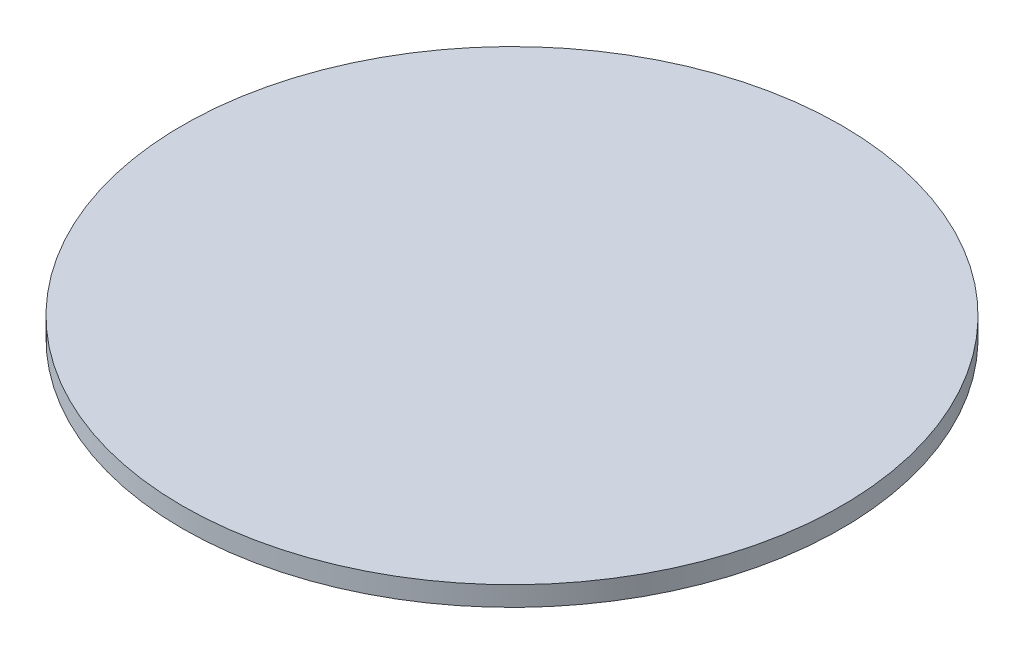
ISO-10303-21;
HEADER;
FILE_DESCRIPTION(('STEP AP214'),'2;1');
FILE_NAME('part.step','',(''),(''),'','','');
FILE_SCHEMA(('AUTOMOTIVE_DESIGN { 1 0 10303 214 1 1 1 1 }'));
ENDSEC;
DATA;
#1=APPLICATION_CONTEXT('core data for automotive mechanical design processes');
#2=APPLICATION_PROTOCOL_DEFINITION('international standard','automotive_design',2000,#1);
#3=PRODUCT_CONTEXT('',#1,'mechanical');
#4=PRODUCT('Part','Part','',(#3));
#5=PRODUCT_RELATED_PRODUCT_CATEGORY('part','',(#4));
#6=PRODUCT_DEFINITION_FORMATION('','',#4);
#7=PRODUCT_DEFINITION_CONTEXT('part definition',#1,'design');
#8=PRODUCT_DEFINITION('design','',#6,#7);
#9=PRODUCT_DEFINITION_SHAPE('','',#8);
#10=(LENGTH_UNIT() NAMED_UNIT(*) SI_UNIT(.MILLI.,.METRE.));
#11=(NAMED_UNIT(*) PLANE_ANGLE_UNIT() SI_UNIT($,.RADIAN.));
#12=(NAMED_UNIT(*) SI_UNIT($,.STERADIAN.) SOLID_ANGLE_UNIT());
#13=UNCERTAINTY_MEASURE_WITH_UNIT(LENGTH_MEASURE(1.E-05),#10,'distance_accuracy_value','');
#14=(GEOMETRIC_REPRESENTATION_CONTEXT(3) GLOBAL_UNCERTAINTY_ASSIGNED_CONTEXT((#13)) GLOBAL_UNIT_ASSIGNED_CONTEXT((#10,
#11,#12)) REPRESENTATION_CONTEXT('',''));
#15=CARTESIAN_POINT('',(0.,0.,0.));
#16=DIRECTION('',(0.,0.,1.));
#17=DIRECTION('',(1.,0.,0.));
#18=AXIS2_PLACEMENT_3D('',#15,#16,#17);
#19=CARTESIAN_POINT('',(0.,2.,0.));
#20=DIRECTION('',(0.,-1.,0.));
#21=DIRECTION('',(0.,0.,-1.));
#22=AXIS2_PLACEMENT_3D('',#19,#20,#21);
#23=CYLINDRICAL_SURFACE('',#22,33.51);
#24=CARTESIAN_POINT('',(0.,2.,0.));
#25=DIRECTION('',(0.,1.,0.));
#26=DIRECTION('',(0.,0.,1.));
#27=AXIS2_PLACEMENT_3D('',#24,#25,#26);
#28=CIRCLE('',#27,33.51);
#29=CARTESIAN_POINT('',(0.,2.,33.51));
#30=VERTEX_POINT('',#29);
#31=EDGE_CURVE('E10',#30,#30,#28,.T.);
#32=ORIENTED_EDGE('',*,*,#31,.F.);
#33=EDGE_LOOP('',(#32));
#34=FACE_BOUND('',#33,.T.);
#35=CARTESIAN_POINT('',(0.,0.,0.));
#36=DIRECTION('',(0.,1.,0.));
#37=DIRECTION('',(0.,0.,1.));
#38=AXIS2_PLACEMENT_3D('',#35,#36,#37);
#39=CIRCLE('',#38,33.51);
#40=CARTESIAN_POINT('',(0.,0.,33.51));
#41=VERTEX_POINT('',#40);
#42=EDGE_CURVE('E40',#41,#41,#39,.T.);
#43=ORIENTED_EDGE('',*,*,#42,.T.);
#44=EDGE_LOOP('',(#43));
#45=FACE_BOUND('',#44,.T.);
#46=ADVANCED_FACE('F37',(#34,#45),#23,.T.);
#47=CARTESIAN_POINT('',(0.,2.,0.));
#48=DIRECTION('',(0.,1.,0.));
#49=DIRECTION('',(0.,0.,1.));
#50=AXIS2_PLACEMENT_3D('',#47,#48,#49);
#51=PLANE('',#50);
#52=ORIENTED_EDGE('',*,*,#31,.T.);
#53=EDGE_LOOP('',(#52));
#54=FACE_BOUND('',#53,.T.);
#55=ADVANCED_FACE('F54',(#54),#51,.T.);
#56=CARTESIAN_POINT('',(0.,0.,0.));
#57=DIRECTION('',(0.,1.,0.));
#58=DIRECTION('',(0.,0.,1.));
#59=AXIS2_PLACEMENT_3D('',#56,#57,#58);
#60=PLANE('',#59);
#61=ORIENTED_EDGE('',*,*,#42,.F.);
#62=EDGE_LOOP('',(#61));
#63=FACE_BOUND('',#62,.T.);
#64=ADVANCED_FACE('F52',(#63),#60,.F.);
#65=CLOSED_SHELL('',(#46,#55,#64));
#66=MANIFOLD_SOLID_BREP('B2',#65);
#67=ADVANCED_BREP_SHAPE_REPRESENTATION('',(#18,#66),#14);
#68=SHAPE_DEFINITION_REPRESENTATION(#9,#67);
ENDSEC;
END-ISO-10303-21;
